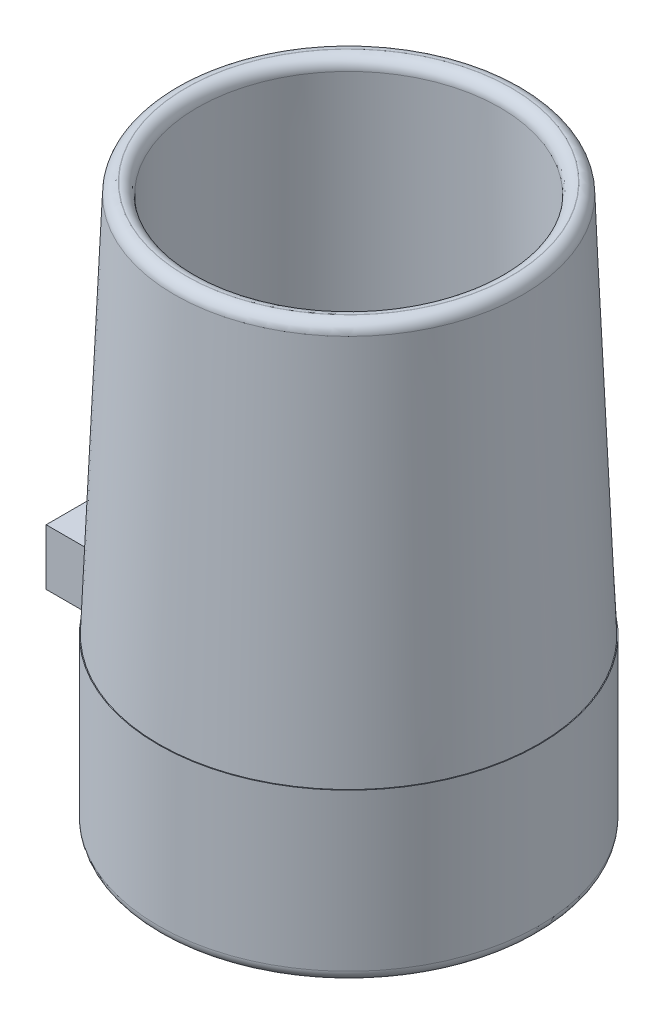
ISO-10303-21;
HEADER;
FILE_DESCRIPTION(('STEP AP214'),'2;1');
FILE_NAME('part.step','',(''),(''),'','','');
FILE_SCHEMA(('AUTOMOTIVE_DESIGN { 1 0 10303 214 1 1 1 1 }'));
ENDSEC;
DATA;
#1=APPLICATION_CONTEXT('core data for automotive mechanical design processes');
#2=APPLICATION_PROTOCOL_DEFINITION('international standard','automotive_design',2000,#1);
#3=PRODUCT_CONTEXT('',#1,'mechanical');
#4=PRODUCT('Part','Part','',(#3));
#5=PRODUCT_RELATED_PRODUCT_CATEGORY('part','',(#4));
#6=PRODUCT_DEFINITION_FORMATION('','',#4);
#7=PRODUCT_DEFINITION_CONTEXT('part definition',#1,'design');
#8=PRODUCT_DEFINITION('design','',#6,#7);
#9=PRODUCT_DEFINITION_SHAPE('','',#8);
#10=(LENGTH_UNIT() NAMED_UNIT(*) SI_UNIT(.MILLI.,.METRE.));
#11=(NAMED_UNIT(*) PLANE_ANGLE_UNIT() SI_UNIT($,.RADIAN.));
#12=(NAMED_UNIT(*) SI_UNIT($,.STERADIAN.) SOLID_ANGLE_UNIT());
#13=UNCERTAINTY_MEASURE_WITH_UNIT(LENGTH_MEASURE(1.E-05),#10,'distance_accuracy_value','');
#14=(GEOMETRIC_REPRESENTATION_CONTEXT(3) GLOBAL_UNCERTAINTY_ASSIGNED_CONTEXT((#13)) GLOBAL_UNIT_ASSIGNED_CONTEXT((#10,
#11,#12)) REPRESENTATION_CONTEXT('',''));
#15=CARTESIAN_POINT('',(0.,0.,0.));
#16=DIRECTION('',(0.,0.,1.));
#17=DIRECTION('',(1.,0.,0.));
#18=AXIS2_PLACEMENT_3D('',#15,#16,#17);
#19=CARTESIAN_POINT('',(0.,0.,0.));
#20=DIRECTION('',(0.,1.,0.));
#21=DIRECTION('',(0.,0.,1.));
#22=AXIS2_PLACEMENT_3D('',#19,#20,#21);
#23=PLANE('',#22);
#24=CARTESIAN_POINT('',(0.,0.,0.));
#25=DIRECTION('',(0.,1.,0.));
#26=DIRECTION('',(0.,0.,1.));
#27=AXIS2_PLACEMENT_3D('',#24,#25,#26);
#28=CIRCLE('',#27,16.);
#29=CARTESIAN_POINT('',(0.,0.,16.));
#30=VERTEX_POINT('',#29);
#31=EDGE_CURVE('E159',#30,#30,#28,.F.);
#32=ORIENTED_EDGE('',*,*,#31,.T.);
#33=EDGE_LOOP('',(#32));
#34=FACE_BOUND('',#33,.T.);
#35=CARTESIAN_POINT('',(0.,0.,0.));
#36=DIRECTION('',(0.,1.,0.));
#37=DIRECTION('',(0.,0.,1.));
#38=AXIS2_PLACEMENT_3D('',#35,#36,#37);
#39=CIRCLE('',#38,15.1);
#40=CARTESIAN_POINT('',(0.,0.,15.1));
#41=VERTEX_POINT('',#40);
#42=EDGE_CURVE('E135',#41,#41,#39,.T.);
#43=ORIENTED_EDGE('',*,*,#42,.T.);
#44=EDGE_LOOP('',(#43));
#45=FACE_BOUND('',#44,.T.);
#46=ADVANCED_FACE('F47',(#34,#45),#23,.F.);
#47=CARTESIAN_POINT('',(0.,15.,0.));
#48=DIRECTION('',(0.,-1.,0.));
#49=DIRECTION('',(0.,0.,-1.));
#50=AXIS2_PLACEMENT_3D('',#47,#48,#49);
#51=CYLINDRICAL_SURFACE('',#50,14.);
#52=CARTESIAN_POINT('',(0.,1.7,0.));
#53=DIRECTION('',(0.,1.,0.));
#54=DIRECTION('',(0.,0.,1.));
#55=AXIS2_PLACEMENT_3D('',#52,#53,#54);
#56=CIRCLE('',#55,14.);
#57=CARTESIAN_POINT('',(0.,1.7,14.));
#58=VERTEX_POINT('',#57);
#59=EDGE_CURVE('E131',#58,#58,#56,.T.);
#60=ORIENTED_EDGE('',*,*,#59,.F.);
#61=EDGE_LOOP('',(#60));
#62=FACE_BOUND('',#61,.T.);
#63=CARTESIAN_POINT('',(0.,15.,0.));
#64=DIRECTION('',(0.,1.,0.));
#65=DIRECTION('',(0.,0.,1.));
#66=AXIS2_PLACEMENT_3D('',#63,#64,#65);
#67=CIRCLE('',#66,14.);
#68=CARTESIAN_POINT('',(0.,15.,14.));
#69=VERTEX_POINT('',#68);
#70=EDGE_CURVE('E127',#69,#69,#67,.T.);
#71=ORIENTED_EDGE('',*,*,#70,.T.);
#72=EDGE_LOOP('',(#71));
#73=FACE_BOUND('',#72,.T.);
#74=ADVANCED_FACE('F195',(#62,#73),#51,.F.);
#75=CARTESIAN_POINT('',(0.,15.,0.));
#76=DIRECTION('',(0.,-1.,0.));
#77=DIRECTION('',(0.,0.,-1.));
#78=AXIS2_PLACEMENT_3D('',#75,#76,#77);
#79=CYLINDRICAL_SURFACE('',#78,17.);
#80=CARTESIAN_POINT('',(0.,1.,0.));
#81=DIRECTION('',(0.,1.,0.));
#82=DIRECTION('',(0.,0.,1.));
#83=AXIS2_PLACEMENT_3D('',#80,#81,#82);
#84=CIRCLE('',#83,17.);
#85=CARTESIAN_POINT('',(0.,1.,17.));
#86=VERTEX_POINT('',#85);
#87=EDGE_CURVE('E156',#86,#86,#84,.T.);
#88=ORIENTED_EDGE('',*,*,#87,.T.);
#89=EDGE_LOOP('',(#88));
#90=FACE_BOUND('',#89,.T.);
#91=CARTESIAN_POINT('',(0.,15.,0.));
#92=DIRECTION('',(0.,1.,0.));
#93=DIRECTION('',(0.,0.,1.));
#94=AXIS2_PLACEMENT_3D('',#91,#92,#93);
#95=CIRCLE('',#94,17.);
#96=CARTESIAN_POINT('',(-16.0277537068951,15.,5.66666666666667));
#97=VERTEX_POINT('',#96);
#98=CARTESIAN_POINT('',(-16.0277537068951,15.,-5.66666666666667));
#99=VERTEX_POINT('',#98);
#100=EDGE_CURVE('E139',#97,#99,#95,.T.);
#101=ORIENTED_EDGE('',*,*,#100,.F.);
#102=DIRECTION('',(0.,-1.,0.));
#103=VECTOR('',#102,1.);
#104=CARTESIAN_POINT('',(-16.0277537068951,15.,5.66666666666667));
#105=LINE('',#104,#103);
#106=CARTESIAN_POINT('',(-16.0277537068951,10.,5.66666666666667));
#107=VERTEX_POINT('',#106);
#108=EDGE_CURVE('E168',#97,#107,#105,.T.);
#109=ORIENTED_EDGE('',*,*,#108,.T.);
#110=CARTESIAN_POINT('',(0.,10.,0.));
#111=DIRECTION('',(0.,-1.,0.));
#112=DIRECTION('',(0.,0.,1.));
#113=AXIS2_PLACEMENT_3D('',#110,#111,#112);
#114=CIRCLE('',#113,17.);
#115=CARTESIAN_POINT('',(-16.0277537068951,10.,-5.66666666666667));
#116=VERTEX_POINT('',#115);
#117=EDGE_CURVE('E114',#107,#116,#114,.T.);
#118=ORIENTED_EDGE('',*,*,#117,.T.);
#119=DIRECTION('',(0.,-1.,0.));
#120=VECTOR('',#119,1.);
#121=CARTESIAN_POINT('',(-16.0277537068951,15.,-5.66666666666667));
#122=LINE('',#121,#120);
#123=EDGE_CURVE('E165',#116,#99,#122,.F.);
#124=ORIENTED_EDGE('',*,*,#123,.T.);
#125=EDGE_LOOP('',(#101,#109,#118,#124));
#126=FACE_BOUND('',#125,.T.);
#127=ADVANCED_FACE('F186',(#90,#126),#79,.T.);
#128=CARTESIAN_POINT('',(0.,15.,0.));
#129=DIRECTION('',(0.,1.,0.));
#130=DIRECTION('',(0.,0.,1.));
#131=AXIS2_PLACEMENT_3D('',#128,#129,#130);
#132=PLANE('',#131);
#133=CARTESIAN_POINT('',(0.,15.,0.));
#134=DIRECTION('',(0.,1.,0.));
#135=DIRECTION('',(0.,0.,1.));
#136=AXIS2_PLACEMENT_3D('',#133,#134,#135);
#137=CIRCLE('',#136,16.9337237305666);
#138=CARTESIAN_POINT('',(0.,15.,16.9337237305666));
#139=VERTEX_POINT('',#138);
#140=EDGE_CURVE('E143',#139,#139,#137,.T.);
#141=ORIENTED_EDGE('',*,*,#140,.F.);
#142=EDGE_LOOP('',(#141));
#143=FACE_BOUND('',#142,.T.);
#144=DIRECTION('',(1.,0.,0.));
#145=VECTOR('',#144,1.);
#146=CARTESIAN_POINT('',(-22.,15.,5.));
#147=LINE('',#146,#145);
#148=CARTESIAN_POINT('',(-22.,15.,5.));
#149=VERTEX_POINT('',#148);
#150=CARTESIAN_POINT('',(-16.9705627484771,15.,5.));
#151=VERTEX_POINT('',#150);
#152=EDGE_CURVE('E106',#149,#151,#147,.T.);
#153=ORIENTED_EDGE('',*,*,#152,.T.);
#154=CARTESIAN_POINT('',(-16.9705627484771,15.,6.));
#155=DIRECTION('',(0.,1.,0.));
#156=DIRECTION('',(0.,0.,1.));
#157=AXIS2_PLACEMENT_3D('',#154,#155,#156);
#158=CIRCLE('',#157,1.);
#159=EDGE_CURVE('E172',#151,#97,#158,.F.);
#160=ORIENTED_EDGE('',*,*,#159,.T.);
#161=ORIENTED_EDGE('',*,*,#100,.T.);
#162=CARTESIAN_POINT('',(-16.9705627484771,15.,-6.));
#163=DIRECTION('',(0.,1.,0.));
#164=DIRECTION('',(0.,0.,1.));
#165=AXIS2_PLACEMENT_3D('',#162,#163,#164);
#166=CIRCLE('',#165,1.);
#167=CARTESIAN_POINT('',(-16.9705627484771,15.,-5.));
#168=VERTEX_POINT('',#167);
#169=EDGE_CURVE('E55',#99,#168,#166,.F.);
#170=ORIENTED_EDGE('',*,*,#169,.T.);
#171=DIRECTION('',(-1.,0.,0.));
#172=VECTOR('',#171,1.);
#173=CARTESIAN_POINT('',(-22.,15.,-5.));
#174=LINE('',#173,#172);
#175=CARTESIAN_POINT('',(-22.,15.,-5.));
#176=VERTEX_POINT('',#175);
#177=EDGE_CURVE('E125',#168,#176,#174,.T.);
#178=ORIENTED_EDGE('',*,*,#177,.T.);
#179=DIRECTION('',(0.,0.,1.));
#180=VECTOR('',#179,1.);
#181=CARTESIAN_POINT('',(-22.,15.,-5.));
#182=LINE('',#181,#180);
#183=EDGE_CURVE('E112',#176,#149,#182,.T.);
#184=ORIENTED_EDGE('',*,*,#183,.T.);
#185=EDGE_LOOP('',(#153,#160,#161,#170,#178,#184));
#186=FACE_BOUND('',#185,.T.);
#187=ADVANCED_FACE('F184',(#143,#186),#132,.T.);
#188=CARTESIAN_POINT('',(0.,1.7,0.));
#189=DIRECTION('',(0.,1.,0.));
#190=DIRECTION('',(0.,0.,1.));
#191=AXIS2_PLACEMENT_3D('',#188,#189,#190);
#192=PLANE('',#191);
#193=CARTESIAN_POINT('',(0.,1.7,0.));
#194=DIRECTION('',(0.,1.,0.));
#195=DIRECTION('',(0.,0.,1.));
#196=AXIS2_PLACEMENT_3D('',#193,#194,#195);
#197=CIRCLE('',#196,15.1);
#198=CARTESIAN_POINT('',(0.,1.7,15.1));
#199=VERTEX_POINT('',#198);
#200=EDGE_CURVE('E136',#199,#199,#197,.T.);
#201=ORIENTED_EDGE('',*,*,#200,.F.);
#202=EDGE_LOOP('',(#201));
#203=FACE_BOUND('',#202,.T.);
#204=ORIENTED_EDGE('',*,*,#59,.T.);
#205=EDGE_LOOP('',(#204));
#206=FACE_BOUND('',#205,.T.);
#207=ADVANCED_FACE('F245',(#203,#206),#192,.F.);
#208=CARTESIAN_POINT('',(0.,1.7,0.));
#209=DIRECTION('',(0.,-1.,0.));
#210=DIRECTION('',(0.,0.,-1.));
#211=AXIS2_PLACEMENT_3D('',#208,#209,#210);
#212=CYLINDRICAL_SURFACE('',#211,15.1);
#213=ORIENTED_EDGE('',*,*,#200,.T.);
#214=EDGE_LOOP('',(#213));
#215=FACE_BOUND('',#214,.T.);
#216=ORIENTED_EDGE('',*,*,#42,.F.);
#217=EDGE_LOOP('',(#216));
#218=FACE_BOUND('',#217,.T.);
#219=ADVANCED_FACE('F254',(#215,#218),#212,.F.);
#220=CARTESIAN_POINT('',(-22.,10.,-5.));
#221=DIRECTION('',(0.,0.,-1.));
#222=DIRECTION('',(-1.,0.,0.));
#223=AXIS2_PLACEMENT_3D('',#220,#221,#222);
#224=PLANE('',#223);
#225=ORIENTED_EDGE('',*,*,#177,.F.);
#226=DIRECTION('',(0.,-1.,0.));
#227=VECTOR('',#226,1.);
#228=CARTESIAN_POINT('',(-16.9705627484771,10.,-5.));
#229=LINE('',#228,#227);
#230=CARTESIAN_POINT('',(-16.9705627484771,10.,-5.));
#231=VERTEX_POINT('',#230);
#232=EDGE_CURVE('E62',#168,#231,#229,.T.);
#233=ORIENTED_EDGE('',*,*,#232,.T.);
#234=DIRECTION('',(-1.,0.,0.));
#235=VECTOR('',#234,1.);
#236=CARTESIAN_POINT('',(-22.,10.,-5.));
#237=LINE('',#236,#235);
#238=CARTESIAN_POINT('',(-22.,10.,-5.));
#239=VERTEX_POINT('',#238);
#240=EDGE_CURVE('E97',#231,#239,#237,.T.);
#241=ORIENTED_EDGE('',*,*,#240,.T.);
#242=DIRECTION('',(0.,1.,0.));
#243=VECTOR('',#242,1.);
#244=CARTESIAN_POINT('',(-22.,10.,-5.));
#245=LINE('',#244,#243);
#246=EDGE_CURVE('E100',#239,#176,#245,.T.);
#247=ORIENTED_EDGE('',*,*,#246,.T.);
#248=EDGE_LOOP('',(#225,#233,#241,#247));
#249=FACE_BOUND('',#248,.T.);
#250=ADVANCED_FACE('F99',(#249),#224,.T.);
#251=CARTESIAN_POINT('',(-22.,10.,5.));
#252=DIRECTION('',(0.,0.,1.));
#253=DIRECTION('',(1.,0.,0.));
#254=AXIS2_PLACEMENT_3D('',#251,#252,#253);
#255=PLANE('',#254);
#256=DIRECTION('',(1.,0.,0.));
#257=VECTOR('',#256,1.);
#258=CARTESIAN_POINT('',(-22.,10.,5.));
#259=LINE('',#258,#257);
#260=CARTESIAN_POINT('',(-22.,10.,5.));
#261=VERTEX_POINT('',#260);
#262=CARTESIAN_POINT('',(-16.9705627484771,10.,5.));
#263=VERTEX_POINT('',#262);
#264=EDGE_CURVE('E119',#261,#263,#259,.T.);
#265=ORIENTED_EDGE('',*,*,#264,.T.);
#266=DIRECTION('',(0.,-1.,0.));
#267=VECTOR('',#266,1.);
#268=CARTESIAN_POINT('',(-16.9705627484771,10.,5.));
#269=LINE('',#268,#267);
#270=EDGE_CURVE('E162',#263,#151,#269,.F.);
#271=ORIENTED_EDGE('',*,*,#270,.T.);
#272=ORIENTED_EDGE('',*,*,#152,.F.);
#273=DIRECTION('',(0.,1.,0.));
#274=VECTOR('',#273,1.);
#275=CARTESIAN_POINT('',(-22.,10.,5.));
#276=LINE('',#275,#274);
#277=EDGE_CURVE('E113',#261,#149,#276,.T.);
#278=ORIENTED_EDGE('',*,*,#277,.F.);
#279=EDGE_LOOP('',(#265,#271,#272,#278));
#280=FACE_BOUND('',#279,.T.);
#281=ADVANCED_FACE('F180',(#280),#255,.T.);
#282=CARTESIAN_POINT('',(-22.,10.,-5.));
#283=DIRECTION('',(-1.,0.,0.));
#284=DIRECTION('',(0.,0.,1.));
#285=AXIS2_PLACEMENT_3D('',#282,#283,#284);
#286=PLANE('',#285);
#287=ORIENTED_EDGE('',*,*,#183,.F.);
#288=ORIENTED_EDGE('',*,*,#246,.F.);
#289=DIRECTION('',(0.,0.,1.));
#290=VECTOR('',#289,1.);
#291=CARTESIAN_POINT('',(-22.,10.,-5.));
#292=LINE('',#291,#290);
#293=EDGE_CURVE('E105',#239,#261,#292,.T.);
#294=ORIENTED_EDGE('',*,*,#293,.T.);
#295=ORIENTED_EDGE('',*,*,#277,.T.);
#296=EDGE_LOOP('',(#287,#288,#294,#295));
#297=FACE_BOUND('',#296,.T.);
#298=ADVANCED_FACE('F110',(#297),#286,.T.);
#299=CARTESIAN_POINT('',(0.,10.,0.));
#300=DIRECTION('',(0.,1.,0.));
#301=DIRECTION('',(0.,0.,1.));
#302=AXIS2_PLACEMENT_3D('',#299,#300,#301);
#303=PLANE('',#302);
#304=ORIENTED_EDGE('',*,*,#240,.F.);
#305=CARTESIAN_POINT('',(-16.9705627484771,10.,-6.));
#306=DIRECTION('',(0.,1.,0.));
#307=DIRECTION('',(0.,0.,1.));
#308=AXIS2_PLACEMENT_3D('',#305,#306,#307);
#309=CIRCLE('',#308,1.);
#310=EDGE_CURVE('E11',#231,#116,#309,.T.);
#311=ORIENTED_EDGE('',*,*,#310,.T.);
#312=ORIENTED_EDGE('',*,*,#117,.F.);
#313=CARTESIAN_POINT('',(-16.9705627484771,10.,6.));
#314=DIRECTION('',(0.,1.,0.));
#315=DIRECTION('',(0.,0.,1.));
#316=AXIS2_PLACEMENT_3D('',#313,#314,#315);
#317=CIRCLE('',#316,1.);
#318=EDGE_CURVE('E174',#107,#263,#317,.T.);
#319=ORIENTED_EDGE('',*,*,#318,.T.);
#320=ORIENTED_EDGE('',*,*,#264,.F.);
#321=ORIENTED_EDGE('',*,*,#293,.F.);
#322=EDGE_LOOP('',(#304,#311,#312,#319,#320,#321));
#323=FACE_BOUND('',#322,.T.);
#324=ADVANCED_FACE('F117',(#323),#303,.F.);
#325=CARTESIAN_POINT('',(15.5,50.,0.));
#326=DIRECTION('',(0.,-1.,0.));
#327=DIRECTION('',(0.,0.,-1.));
#328=AXIS2_PLACEMENT_3D('',#325,#326,#327);
#329=PLANE('',#328);
#330=CARTESIAN_POINT('',(0.,50.,0.));
#331=DIRECTION('',(0.,-1.,0.));
#332=DIRECTION('',(0.,0.,-1.));
#333=AXIS2_PLACEMENT_3D('',#330,#331,#332);
#334=CIRCLE('',#333,14.5401248812229);
#335=CARTESIAN_POINT('',(0.,50.,-14.5401248812229));
#336=VERTEX_POINT('',#335);
#337=EDGE_CURVE('E147',#336,#336,#334,.F.);
#338=ORIENTED_EDGE('',*,*,#337,.T.);
#339=EDGE_LOOP('',(#338));
#340=FACE_BOUND('',#339,.T.);
#341=CARTESIAN_POINT('',(0.,50.,0.));
#342=DIRECTION('',(0.,-1.,0.));
#343=DIRECTION('',(0.,0.,-1.));
#344=AXIS2_PLACEMENT_3D('',#341,#342,#343);
#345=CIRCLE('',#344,14.5143877498964);
#346=CARTESIAN_POINT('',(0.,50.,-14.5143877498964));
#347=VERTEX_POINT('',#346);
#348=EDGE_CURVE('E144',#347,#347,#345,.T.);
#349=ORIENTED_EDGE('',*,*,#348,.T.);
#350=EDGE_LOOP('',(#349));
#351=FACE_BOUND('',#350,.T.);
#352=ADVANCED_FACE('F269',(#340,#351),#329,.F.);
#353=CARTESIAN_POINT('',(0.,50.,0.));
#354=DIRECTION('',(0.,-1.,0.));
#355=DIRECTION('',(0.,0.,-1.));
#356=AXIS2_PLACEMENT_3D('',#353,#354,#355);
#357=CONICAL_SURFACE('',#356,13.5,0.0142847425873966);
#358=CARTESIAN_POINT('',(0.,48.9857157432172,0.));
#359=DIRECTION('',(0.,1.,0.));
#360=DIRECTION('',(0.,0.,1.));
#361=AXIS2_PLACEMENT_3D('',#358,#359,#360);
#362=CIRCLE('',#361,13.5144897750969);
#363=CARTESIAN_POINT('',(0.,48.9857157432172,13.5144897750969));
#364=VERTEX_POINT('',#363);
#365=EDGE_CURVE('E153',#364,#364,#362,.T.);
#366=ORIENTED_EDGE('',*,*,#365,.T.);
#367=EDGE_LOOP('',(#366));
#368=FACE_BOUND('',#367,.T.);
#369=ORIENTED_EDGE('',*,*,#70,.F.);
#370=EDGE_LOOP('',(#369));
#371=FACE_BOUND('',#370,.T.);
#372=ADVANCED_FACE('F299',(#368,#371),#357,.F.);
#373=CARTESIAN_POINT('',(0.,15.,0.));
#374=DIRECTION('',(0.,-1.,0.));
#375=DIRECTION('',(0.,0.,-1.));
#376=AXIS2_PLACEMENT_3D('',#373,#374,#375);
#377=CONICAL_SURFACE('',#376,16.9337237305666,0.0409406457760437);
#378=CARTESIAN_POINT('',(0.,49.0409292097162,0.));
#379=DIRECTION('',(0.,1.,0.));
#380=DIRECTION('',(0.,0.,1.));
#381=AXIS2_PLACEMENT_3D('',#378,#379,#380);
#382=CIRCLE('',#381,15.5392869300378);
#383=CARTESIAN_POINT('',(0.,49.0409292097162,15.5392869300378));
#384=VERTEX_POINT('',#383);
#385=EDGE_CURVE('E150',#384,#384,#382,.F.);
#386=ORIENTED_EDGE('',*,*,#385,.T.);
#387=EDGE_LOOP('',(#386));
#388=FACE_BOUND('',#387,.T.);
#389=ORIENTED_EDGE('',*,*,#140,.T.);
#390=EDGE_LOOP('',(#389));
#391=FACE_BOUND('',#390,.T.);
#392=ADVANCED_FACE('F216',(#388,#391),#377,.T.);
#393=CARTESIAN_POINT('',(0.,49.,0.));
#394=DIRECTION('',(0.,-1.,0.));
#395=DIRECTION('',(0.,0.,-1.));
#396=AXIS2_PLACEMENT_3D('',#393,#394,#395);
#397=TOROIDAL_SURFACE('',#396,14.5401248812229,1.);
#398=ORIENTED_EDGE('',*,*,#385,.F.);
#399=EDGE_LOOP('',(#398));
#400=FACE_BOUND('',#399,.T.);
#401=ORIENTED_EDGE('',*,*,#337,.F.);
#402=EDGE_LOOP('',(#401));
#403=FACE_BOUND('',#402,.T.);
#404=ADVANCED_FACE('F212',(#400,#403),#397,.T.);
#405=CARTESIAN_POINT('',(0.,49.,0.));
#406=DIRECTION('',(0.,-1.,0.));
#407=DIRECTION('',(0.,0.,-1.));
#408=AXIS2_PLACEMENT_3D('',#405,#406,#407);
#409=TOROIDAL_SURFACE('',#408,14.5143877498964,1.);
#410=ORIENTED_EDGE('',*,*,#348,.F.);
#411=EDGE_LOOP('',(#410));
#412=FACE_BOUND('',#411,.T.);
#413=ORIENTED_EDGE('',*,*,#365,.F.);
#414=EDGE_LOOP('',(#413));
#415=FACE_BOUND('',#414,.T.);
#416=ADVANCED_FACE('F215',(#412,#415),#409,.T.);
#417=CARTESIAN_POINT('',(0.,1.,0.));
#418=DIRECTION('',(0.,1.,0.));
#419=DIRECTION('',(0.,0.,1.));
#420=AXIS2_PLACEMENT_3D('',#417,#418,#419);
#421=TOROIDAL_SURFACE('',#420,16.,1.);
#422=ORIENTED_EDGE('',*,*,#31,.F.);
#423=EDGE_LOOP('',(#422));
#424=FACE_BOUND('',#423,.T.);
#425=ORIENTED_EDGE('',*,*,#87,.F.);
#426=EDGE_LOOP('',(#425));
#427=FACE_BOUND('',#426,.T.);
#428=ADVANCED_FACE('F193',(#424,#427),#421,.T.);
#429=CARTESIAN_POINT('',(-16.9705627484771,15.,6.));
#430=DIRECTION('',(0.,-1.,0.));
#431=DIRECTION('',(0.,0.,-1.));
#432=AXIS2_PLACEMENT_3D('',#429,#430,#431);
#433=CYLINDRICAL_SURFACE('',#432,1.);
#434=ORIENTED_EDGE('',*,*,#318,.F.);
#435=ORIENTED_EDGE('',*,*,#108,.F.);
#436=ORIENTED_EDGE('',*,*,#159,.F.);
#437=ORIENTED_EDGE('',*,*,#270,.F.);
#438=EDGE_LOOP('',(#434,#435,#436,#437));
#439=FACE_BOUND('',#438,.T.);
#440=ADVANCED_FACE('F182',(#439),#433,.F.);
#441=CARTESIAN_POINT('',(-16.9705627484771,15.,-6.));
#442=DIRECTION('',(0.,-1.,0.));
#443=DIRECTION('',(0.,0.,-1.));
#444=AXIS2_PLACEMENT_3D('',#441,#442,#443);
#445=CYLINDRICAL_SURFACE('',#444,1.);
#446=ORIENTED_EDGE('',*,*,#310,.F.);
#447=ORIENTED_EDGE('',*,*,#232,.F.);
#448=ORIENTED_EDGE('',*,*,#169,.F.);
#449=ORIENTED_EDGE('',*,*,#123,.F.);
#450=EDGE_LOOP('',(#446,#447,#448,#449));
#451=FACE_BOUND('',#450,.T.);
#452=ADVANCED_FACE('F49',(#451),#445,.F.);
#453=CLOSED_SHELL('',(#46,#74,#127,#187,#207,#219,#250,#281,#298,#324,#352,#372,#392,#404,#416,
#428,#440,#452));
#454=MANIFOLD_SOLID_BREP('B2',#453);
#455=ADVANCED_BREP_SHAPE_REPRESENTATION('',(#18,#454),#14);
#456=SHAPE_DEFINITION_REPRESENTATION(#9,#455);
ENDSEC;
END-ISO-10303-21;
